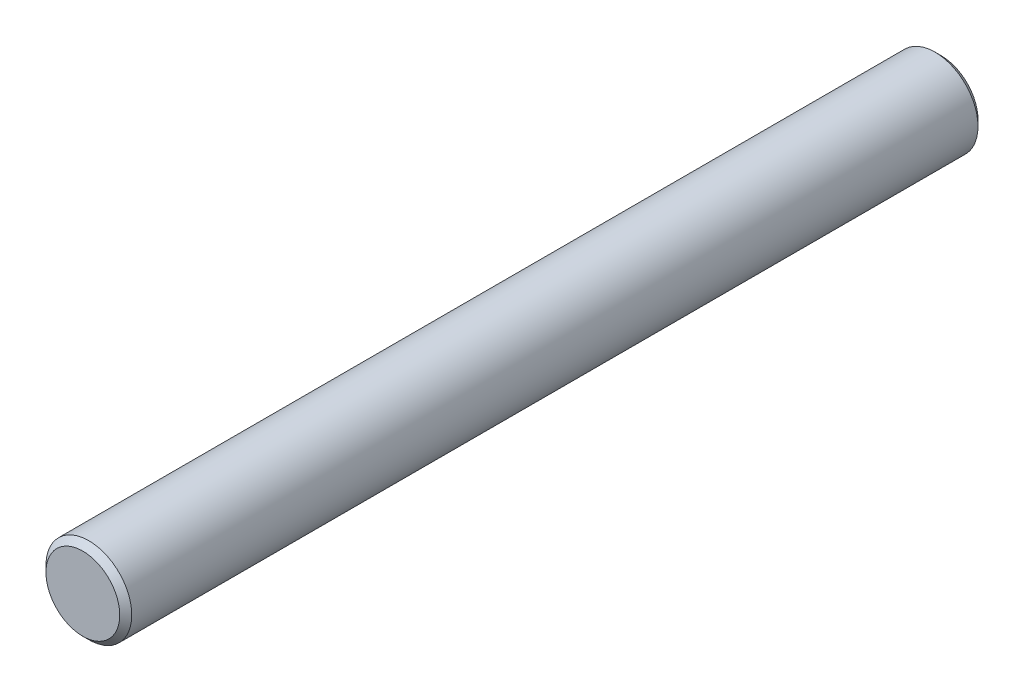
ISO-10303-21;
HEADER;
FILE_DESCRIPTION(('STEP AP214'),'2;1');
FILE_NAME('part.step','',(''),(''),'','','');
FILE_SCHEMA(('AUTOMOTIVE_DESIGN { 1 0 10303 214 1 1 1 1 }'));
ENDSEC;
DATA;
#1=APPLICATION_CONTEXT('core data for automotive mechanical design processes');
#2=APPLICATION_PROTOCOL_DEFINITION('international standard','automotive_design',2000,#1);
#3=PRODUCT_CONTEXT('',#1,'mechanical');
#4=PRODUCT('Part','Part','',(#3));
#5=PRODUCT_RELATED_PRODUCT_CATEGORY('part','',(#4));
#6=PRODUCT_DEFINITION_FORMATION('','',#4);
#7=PRODUCT_DEFINITION_CONTEXT('part definition',#1,'design');
#8=PRODUCT_DEFINITION('design','',#6,#7);
#9=PRODUCT_DEFINITION_SHAPE('','',#8);
#10=(LENGTH_UNIT() NAMED_UNIT(*) SI_UNIT(.MILLI.,.METRE.));
#11=(NAMED_UNIT(*) PLANE_ANGLE_UNIT() SI_UNIT($,.RADIAN.));
#12=(NAMED_UNIT(*) SI_UNIT($,.STERADIAN.) SOLID_ANGLE_UNIT());
#13=UNCERTAINTY_MEASURE_WITH_UNIT(LENGTH_MEASURE(1.E-05),#10,'distance_accuracy_value','');
#14=(GEOMETRIC_REPRESENTATION_CONTEXT(3) GLOBAL_UNCERTAINTY_ASSIGNED_CONTEXT((#13)) GLOBAL_UNIT_ASSIGNED_CONTEXT((#10,
#11,#12)) REPRESENTATION_CONTEXT('',''));
#15=CARTESIAN_POINT('',(0.,0.,0.));
#16=DIRECTION('',(0.,0.,1.));
#17=DIRECTION('',(1.,0.,0.));
#18=AXIS2_PLACEMENT_3D('',#15,#16,#17);
#19=CARTESIAN_POINT('',(0.,0.,25.));
#20=DIRECTION('',(0.,0.,-1.));
#21=DIRECTION('',(-1.,0.,0.));
#22=AXIS2_PLACEMENT_3D('',#19,#20,#21);
#23=CYLINDRICAL_SURFACE('',#22,2.5);
#24=CARTESIAN_POINT('',(0.,0.,-24.65));
#25=DIRECTION('',(0.,0.,1.));
#26=DIRECTION('',(1.,0.,0.));
#27=AXIS2_PLACEMENT_3D('',#24,#25,#26);
#28=CIRCLE('',#27,2.5);
#29=CARTESIAN_POINT('',(2.5,0.,-24.65));
#30=VERTEX_POINT('',#29);
#31=EDGE_CURVE('E46',#30,#30,#28,.T.);
#32=ORIENTED_EDGE('',*,*,#31,.T.);
#33=EDGE_LOOP('',(#32));
#34=FACE_BOUND('',#33,.T.);
#35=CARTESIAN_POINT('',(0.,0.,24.65));
#36=DIRECTION('',(0.,0.,1.));
#37=DIRECTION('',(1.,0.,0.));
#38=AXIS2_PLACEMENT_3D('',#35,#36,#37);
#39=CIRCLE('',#38,2.5);
#40=CARTESIAN_POINT('',(2.5,0.,24.65));
#41=VERTEX_POINT('',#40);
#42=EDGE_CURVE('E50',#41,#41,#39,.F.);
#43=ORIENTED_EDGE('',*,*,#42,.T.);
#44=EDGE_LOOP('',(#43));
#45=FACE_BOUND('',#44,.T.);
#46=ADVANCED_FACE('F35',(#34,#45),#23,.T.);
#47=CARTESIAN_POINT('',(0.,0.,25.));
#48=DIRECTION('',(0.,0.,1.));
#49=DIRECTION('',(1.,0.,0.));
#50=AXIS2_PLACEMENT_3D('',#47,#48,#49);
#51=PLANE('',#50);
#52=CARTESIAN_POINT('',(0.,0.,25.));
#53=DIRECTION('',(0.,0.,1.));
#54=DIRECTION('',(1.,0.,0.));
#55=AXIS2_PLACEMENT_3D('',#52,#53,#54);
#56=CIRCLE('',#55,2.15000000000001);
#57=CARTESIAN_POINT('',(2.15000000000001,0.,25.));
#58=VERTEX_POINT('',#57);
#59=EDGE_CURVE('E10',#58,#58,#56,.T.);
#60=ORIENTED_EDGE('',*,*,#59,.T.);
#61=EDGE_LOOP('',(#60));
#62=FACE_BOUND('',#61,.T.);
#63=ADVANCED_FACE('F66',(#62),#51,.T.);
#64=CARTESIAN_POINT('',(0.,0.,-25.));
#65=DIRECTION('',(0.,0.,1.));
#66=DIRECTION('',(1.,0.,0.));
#67=AXIS2_PLACEMENT_3D('',#64,#65,#66);
#68=PLANE('',#67);
#69=CARTESIAN_POINT('',(0.,0.,-25.));
#70=DIRECTION('',(0.,0.,1.));
#71=DIRECTION('',(1.,0.,0.));
#72=AXIS2_PLACEMENT_3D('',#69,#70,#71);
#73=CIRCLE('',#72,2.15);
#74=CARTESIAN_POINT('',(2.15,0.,-25.));
#75=VERTEX_POINT('',#74);
#76=EDGE_CURVE('E42',#75,#75,#73,.F.);
#77=ORIENTED_EDGE('',*,*,#76,.T.);
#78=EDGE_LOOP('',(#77));
#79=FACE_BOUND('',#78,.T.);
#80=ADVANCED_FACE('F63',(#79),#68,.F.);
#81=CARTESIAN_POINT('',(0.,0.,-24.65));
#82=DIRECTION('',(0.,0.,1.));
#83=DIRECTION('',(1.,0.,0.));
#84=AXIS2_PLACEMENT_3D('',#81,#82,#83);
#85=CONICAL_SURFACE('',#84,2.5,0.785398163397445);
#86=ORIENTED_EDGE('',*,*,#76,.F.);
#87=EDGE_LOOP('',(#86));
#88=FACE_BOUND('',#87,.T.);
#89=ORIENTED_EDGE('',*,*,#31,.F.);
#90=EDGE_LOOP('',(#89));
#91=FACE_BOUND('',#90,.T.);
#92=ADVANCED_FACE('F59',(#88,#91),#85,.T.);
#93=CARTESIAN_POINT('',(0.,0.,25.));
#94=DIRECTION('',(0.,0.,-1.));
#95=DIRECTION('',(-1.,0.,0.));
#96=AXIS2_PLACEMENT_3D('',#93,#94,#95);
#97=CONICAL_SURFACE('',#96,2.15000000000001,0.785398163397455);
#98=ORIENTED_EDGE('',*,*,#42,.F.);
#99=EDGE_LOOP('',(#98));
#100=FACE_BOUND('',#99,.T.);
#101=ORIENTED_EDGE('',*,*,#59,.F.);
#102=EDGE_LOOP('',(#101));
#103=FACE_BOUND('',#102,.T.);
#104=ADVANCED_FACE('F37',(#100,#103),#97,.T.);
#105=CLOSED_SHELL('',(#46,#63,#80,#92,#104));
#106=MANIFOLD_SOLID_BREP('B2',#105);
#107=ADVANCED_BREP_SHAPE_REPRESENTATION('',(#18,#106),#14);
#108=SHAPE_DEFINITION_REPRESENTATION(#9,#107);
ENDSEC;
END-ISO-10303-21;
